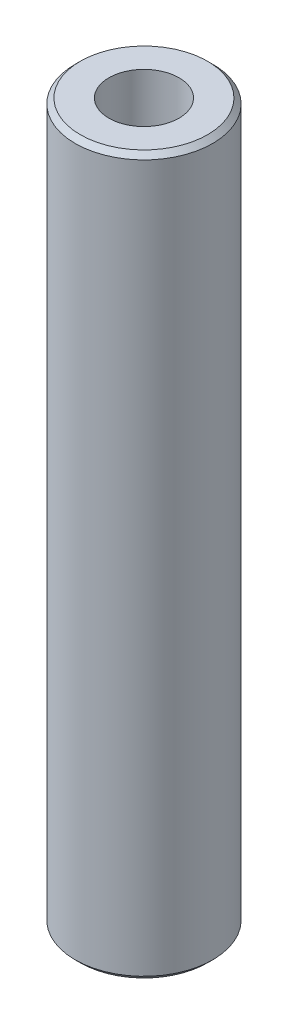
ISO-10303-21;
HEADER;
FILE_DESCRIPTION(('STEP AP214'),'2;1');
FILE_NAME('part.step','',(''),(''),'','','');
FILE_SCHEMA(('AUTOMOTIVE_DESIGN { 1 0 10303 214 1 1 1 1 }'));
ENDSEC;
DATA;
#1=APPLICATION_CONTEXT('core data for automotive mechanical design processes');
#2=APPLICATION_PROTOCOL_DEFINITION('international standard','automotive_design',2000,#1);
#3=PRODUCT_CONTEXT('',#1,'mechanical');
#4=PRODUCT('Part','Part','',(#3));
#5=PRODUCT_RELATED_PRODUCT_CATEGORY('part','',(#4));
#6=PRODUCT_DEFINITION_FORMATION('','',#4);
#7=PRODUCT_DEFINITION_CONTEXT('part definition',#1,'design');
#8=PRODUCT_DEFINITION('design','',#6,#7);
#9=PRODUCT_DEFINITION_SHAPE('','',#8);
#10=(LENGTH_UNIT() NAMED_UNIT(*) SI_UNIT(.MILLI.,.METRE.));
#11=(NAMED_UNIT(*) PLANE_ANGLE_UNIT() SI_UNIT($,.RADIAN.));
#12=(NAMED_UNIT(*) SI_UNIT($,.STERADIAN.) SOLID_ANGLE_UNIT());
#13=UNCERTAINTY_MEASURE_WITH_UNIT(LENGTH_MEASURE(1.E-05),#10,'distance_accuracy_value','');
#14=(GEOMETRIC_REPRESENTATION_CONTEXT(3) GLOBAL_UNCERTAINTY_ASSIGNED_CONTEXT((#13)) GLOBAL_UNIT_ASSIGNED_CONTEXT((#10,
#11,#12)) REPRESENTATION_CONTEXT('',''));
#15=CARTESIAN_POINT('',(0.,0.,0.));
#16=DIRECTION('',(0.,0.,1.));
#17=DIRECTION('',(1.,0.,0.));
#18=AXIS2_PLACEMENT_3D('',#15,#16,#17);
#19=CARTESIAN_POINT('',(0.,600.,0.));
#20=DIRECTION('',(0.,-1.,0.));
#21=DIRECTION('',(0.,0.,-1.));
#22=AXIS2_PLACEMENT_3D('',#19,#20,#21);
#23=CYLINDRICAL_SURFACE('',#22,57.5);
#24=CARTESIAN_POINT('',(0.,595.761411237607,0.));
#25=DIRECTION('',(0.,1.,0.));
#26=DIRECTION('',(0.,0.,1.));
#27=AXIS2_PLACEMENT_3D('',#24,#25,#26);
#28=CIRCLE('',#27,57.5);
#29=CARTESIAN_POINT('',(0.,595.761411237607,57.5));
#30=VERTEX_POINT('',#29);
#31=EDGE_CURVE('E50',#30,#30,#28,.F.);
#32=ORIENTED_EDGE('',*,*,#31,.T.);
#33=EDGE_LOOP('',(#32));
#34=FACE_BOUND('',#33,.T.);
#35=CARTESIAN_POINT('',(0.,4.2385887623928,0.));
#36=DIRECTION('',(0.,1.,0.));
#37=DIRECTION('',(0.,0.,1.));
#38=AXIS2_PLACEMENT_3D('',#35,#36,#37);
#39=CIRCLE('',#38,57.5);
#40=CARTESIAN_POINT('',(0.,4.2385887623928,57.5));
#41=VERTEX_POINT('',#40);
#42=EDGE_CURVE('E51',#41,#41,#39,.T.);
#43=ORIENTED_EDGE('',*,*,#42,.T.);
#44=EDGE_LOOP('',(#43));
#45=FACE_BOUND('',#44,.T.);
#46=ADVANCED_FACE('F39',(#34,#45),#23,.T.);
#47=CARTESIAN_POINT('',(0.,600.,0.));
#48=DIRECTION('',(0.,1.,0.));
#49=DIRECTION('',(0.,0.,1.));
#50=AXIS2_PLACEMENT_3D('',#47,#48,#49);
#51=PLANE('',#50);
#52=CARTESIAN_POINT('',(0.,600.,0.));
#53=DIRECTION('',(0.,1.,0.));
#54=DIRECTION('',(0.,0.,1.));
#55=AXIS2_PLACEMENT_3D('',#52,#53,#54);
#56=CIRCLE('',#55,53.2614112376074);
#57=CARTESIAN_POINT('',(0.,600.,53.2614112376074));
#58=VERTEX_POINT('',#57);
#59=EDGE_CURVE('E54',#58,#58,#56,.T.);
#60=ORIENTED_EDGE('',*,*,#59,.T.);
#61=EDGE_LOOP('',(#60));
#62=FACE_BOUND('',#61,.T.);
#63=CARTESIAN_POINT('',(0.,600.,0.));
#64=DIRECTION('',(0.,1.,0.));
#65=DIRECTION('',(0.,0.,1.));
#66=AXIS2_PLACEMENT_3D('',#63,#64,#65);
#67=CIRCLE('',#66,29.3424492610044);
#68=CARTESIAN_POINT('',(0.,600.,29.3424492610044));
#69=VERTEX_POINT('',#68);
#70=EDGE_CURVE('E58',#69,#69,#67,.T.);
#71=ORIENTED_EDGE('',*,*,#70,.F.);
#72=EDGE_LOOP('',(#71));
#73=FACE_BOUND('',#72,.T.);
#74=ADVANCED_FACE('F69',(#62,#73),#51,.T.);
#75=CARTESIAN_POINT('',(0.,0.,0.));
#76=DIRECTION('',(0.,1.,0.));
#77=DIRECTION('',(0.,0.,1.));
#78=AXIS2_PLACEMENT_3D('',#75,#76,#77);
#79=PLANE('',#78);
#80=CARTESIAN_POINT('',(0.,0.,0.));
#81=DIRECTION('',(0.,1.,0.));
#82=DIRECTION('',(0.,0.,1.));
#83=AXIS2_PLACEMENT_3D('',#80,#81,#82);
#84=CIRCLE('',#83,53.2614112376072);
#85=CARTESIAN_POINT('',(0.,0.,53.2614112376072));
#86=VERTEX_POINT('',#85);
#87=EDGE_CURVE('E10',#86,#86,#84,.F.);
#88=ORIENTED_EDGE('',*,*,#87,.T.);
#89=EDGE_LOOP('',(#88));
#90=FACE_BOUND('',#89,.T.);
#91=CARTESIAN_POINT('',(0.,0.,0.));
#92=DIRECTION('',(0.,1.,0.));
#93=DIRECTION('',(0.,0.,1.));
#94=AXIS2_PLACEMENT_3D('',#91,#92,#93);
#95=CIRCLE('',#94,29.3424492610044);
#96=CARTESIAN_POINT('',(0.,0.,29.3424492610044));
#97=VERTEX_POINT('',#96);
#98=EDGE_CURVE('E63',#97,#97,#95,.T.);
#99=ORIENTED_EDGE('',*,*,#98,.T.);
#100=EDGE_LOOP('',(#99));
#101=FACE_BOUND('',#100,.T.);
#102=ADVANCED_FACE('F75',(#90,#101),#79,.F.);
#103=CARTESIAN_POINT('',(0.,600.,0.));
#104=DIRECTION('',(0.,-1.,0.));
#105=DIRECTION('',(0.,0.,-1.));
#106=AXIS2_PLACEMENT_3D('',#103,#104,#105);
#107=CYLINDRICAL_SURFACE('',#106,29.3424492610044);
#108=ORIENTED_EDGE('',*,*,#70,.T.);
#109=EDGE_LOOP('',(#108));
#110=FACE_BOUND('',#109,.T.);
#111=ORIENTED_EDGE('',*,*,#98,.F.);
#112=EDGE_LOOP('',(#111));
#113=FACE_BOUND('',#112,.T.);
#114=ADVANCED_FACE('F70',(#110,#113),#107,.F.);
#115=CARTESIAN_POINT('',(0.,600.,0.));
#116=DIRECTION('',(0.,-1.,0.));
#117=DIRECTION('',(0.,0.,-1.));
#118=AXIS2_PLACEMENT_3D('',#115,#116,#117);
#119=CONICAL_SURFACE('',#118,53.2614112376074,0.785398163397436);
#120=ORIENTED_EDGE('',*,*,#31,.F.);
#121=EDGE_LOOP('',(#120));
#122=FACE_BOUND('',#121,.T.);
#123=ORIENTED_EDGE('',*,*,#59,.F.);
#124=EDGE_LOOP('',(#123));
#125=FACE_BOUND('',#124,.T.);
#126=ADVANCED_FACE('F81',(#122,#125),#119,.T.);
#127=CARTESIAN_POINT('',(0.,4.2385887623928,0.));
#128=DIRECTION('',(0.,1.,0.));
#129=DIRECTION('',(0.,0.,1.));
#130=AXIS2_PLACEMENT_3D('',#127,#128,#129);
#131=CONICAL_SURFACE('',#130,57.5,0.785398163397448);
#132=ORIENTED_EDGE('',*,*,#87,.F.);
#133=EDGE_LOOP('',(#132));
#134=FACE_BOUND('',#133,.T.);
#135=ORIENTED_EDGE('',*,*,#42,.F.);
#136=EDGE_LOOP('',(#135));
#137=FACE_BOUND('',#136,.T.);
#138=ADVANCED_FACE('F45',(#134,#137),#131,.T.);
#139=CLOSED_SHELL('',(#46,#74,#102,#114,#126,#138));
#140=MANIFOLD_SOLID_BREP('B2',#139);
#141=ADVANCED_BREP_SHAPE_REPRESENTATION('',(#18,#140),#14);
#142=SHAPE_DEFINITION_REPRESENTATION(#9,#141);
ENDSEC;
END-ISO-10303-21;
